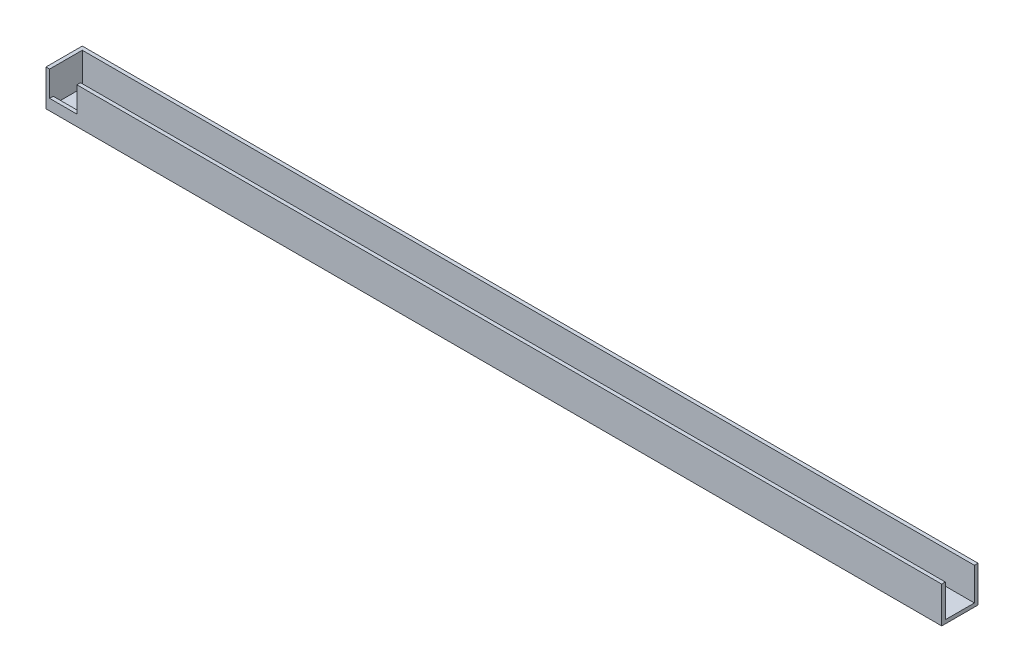
ISO-10303-21;
HEADER;
FILE_DESCRIPTION(('STEP AP214'),'2;1');
FILE_NAME('part.step','',(''),(''),'','','');
FILE_SCHEMA(('AUTOMOTIVE_DESIGN { 1 0 10303 214 1 1 1 1 }'));
ENDSEC;
DATA;
#1=APPLICATION_CONTEXT('core data for automotive mechanical design processes');
#2=APPLICATION_PROTOCOL_DEFINITION('international standard','automotive_design',2000,#1);
#3=PRODUCT_CONTEXT('',#1,'mechanical');
#4=PRODUCT('Part','Part','',(#3));
#5=PRODUCT_RELATED_PRODUCT_CATEGORY('part','',(#4));
#6=PRODUCT_DEFINITION_FORMATION('','',#4);
#7=PRODUCT_DEFINITION_CONTEXT('part definition',#1,'design');
#8=PRODUCT_DEFINITION('design','',#6,#7);
#9=PRODUCT_DEFINITION_SHAPE('','',#8);
#10=(LENGTH_UNIT() NAMED_UNIT(*) SI_UNIT(.MILLI.,.METRE.));
#11=(NAMED_UNIT(*) PLANE_ANGLE_UNIT() SI_UNIT($,.RADIAN.));
#12=(NAMED_UNIT(*) SI_UNIT($,.STERADIAN.) SOLID_ANGLE_UNIT());
#13=UNCERTAINTY_MEASURE_WITH_UNIT(LENGTH_MEASURE(1.E-05),#10,'distance_accuracy_value','');
#14=(GEOMETRIC_REPRESENTATION_CONTEXT(3) GLOBAL_UNCERTAINTY_ASSIGNED_CONTEXT((#13)) GLOBAL_UNIT_ASSIGNED_CONTEXT((#10,
#11,#12)) REPRESENTATION_CONTEXT('',''));
#15=CARTESIAN_POINT('',(0.,0.,0.));
#16=DIRECTION('',(0.,0.,1.));
#17=DIRECTION('',(1.,0.,0.));
#18=AXIS2_PLACEMENT_3D('',#15,#16,#17);
#19=CARTESIAN_POINT('',(-784.225,63.5,63.5));
#20=DIRECTION('',(0.,-1.,0.));
#21=DIRECTION('',(0.,0.,-1.));
#22=AXIS2_PLACEMENT_3D('',#19,#20,#21);
#23=PLANE('',#22);
#24=DIRECTION('',(-1.,0.,0.));
#25=VECTOR('',#24,1.);
#26=CARTESIAN_POINT('',(-784.225,63.5,63.5));
#27=LINE('',#26,#25);
#28=CARTESIAN_POINT('',(-777.875,63.5,63.5));
#29=VERTEX_POINT('',#28);
#30=CARTESIAN_POINT('',(-784.225,63.5,63.5));
#31=VERTEX_POINT('',#30);
#32=EDGE_CURVE('E212',#29,#31,#27,.T.);
#33=ORIENTED_EDGE('',*,*,#32,.F.);
#34=DIRECTION('',(0.,0.,-1.));
#35=VECTOR('',#34,1.);
#36=CARTESIAN_POINT('',(-777.875,63.5,63.5));
#37=LINE('',#36,#35);
#38=CARTESIAN_POINT('',(-777.875,63.5,6.35));
#39=VERTEX_POINT('',#38);
#40=EDGE_CURVE('E153',#29,#39,#37,.T.);
#41=ORIENTED_EDGE('',*,*,#40,.T.);
#42=DIRECTION('',(-1.,0.,0.));
#43=VECTOR('',#42,1.);
#44=CARTESIAN_POINT('',(-784.225,63.5,6.35));
#45=LINE('',#44,#43);
#46=CARTESIAN_POINT('',(784.225,63.5,6.35));
#47=VERTEX_POINT('',#46);
#48=EDGE_CURVE('E177',#47,#39,#45,.T.);
#49=ORIENTED_EDGE('',*,*,#48,.F.);
#50=DIRECTION('',(0.,0.,-1.));
#51=VECTOR('',#50,1.);
#52=CARTESIAN_POINT('',(784.225,63.5,63.5));
#53=LINE('',#52,#51);
#54=CARTESIAN_POINT('',(784.225,63.5,0.));
#55=VERTEX_POINT('',#54);
#56=EDGE_CURVE('E52',#47,#55,#53,.T.);
#57=ORIENTED_EDGE('',*,*,#56,.T.);
#58=DIRECTION('',(-1.,0.,0.));
#59=VECTOR('',#58,1.);
#60=CARTESIAN_POINT('',(-784.225,63.5,0.));
#61=LINE('',#60,#59);
#62=CARTESIAN_POINT('',(-784.225,63.5,0.));
#63=VERTEX_POINT('',#62);
#64=EDGE_CURVE('E224',#55,#63,#61,.T.);
#65=ORIENTED_EDGE('',*,*,#64,.T.);
#66=DIRECTION('',(0.,0.,-1.));
#67=VECTOR('',#66,1.);
#68=CARTESIAN_POINT('',(-784.225,63.5,63.5));
#69=LINE('',#68,#67);
#70=EDGE_CURVE('E236',#31,#63,#69,.T.);
#71=ORIENTED_EDGE('',*,*,#70,.F.);
#72=EDGE_LOOP('',(#33,#41,#49,#57,#65,#71));
#73=FACE_BOUND('',#72,.T.);
#74=ADVANCED_FACE('F43',(#73),#23,.F.);
#75=CARTESIAN_POINT('',(784.225,63.5,63.5));
#76=DIRECTION('',(-1.,0.,0.));
#77=DIRECTION('',(0.,0.,1.));
#78=AXIS2_PLACEMENT_3D('',#75,#76,#77);
#79=PLANE('',#78);
#80=DIRECTION('',(0.,1.,0.));
#81=VECTOR('',#80,1.);
#82=CARTESIAN_POINT('',(784.225,63.5,6.35));
#83=LINE('',#82,#81);
#84=CARTESIAN_POINT('',(784.225,6.35,6.35));
#85=VERTEX_POINT('',#84);
#86=EDGE_CURVE('E172',#85,#47,#83,.T.);
#87=ORIENTED_EDGE('',*,*,#86,.F.);
#88=DIRECTION('',(0.,0.,-1.));
#89=VECTOR('',#88,1.);
#90=CARTESIAN_POINT('',(784.225,6.35,63.5));
#91=LINE('',#90,#89);
#92=CARTESIAN_POINT('',(784.225,6.35,57.15));
#93=VERTEX_POINT('',#92);
#94=EDGE_CURVE('E182',#93,#85,#91,.T.);
#95=ORIENTED_EDGE('',*,*,#94,.F.);
#96=DIRECTION('',(0.,1.,0.));
#97=VECTOR('',#96,1.);
#98=CARTESIAN_POINT('',(784.225,63.5,57.15));
#99=LINE('',#98,#97);
#100=CARTESIAN_POINT('',(784.225,63.5,57.15));
#101=VERTEX_POINT('',#100);
#102=EDGE_CURVE('E190',#93,#101,#99,.T.);
#103=ORIENTED_EDGE('',*,*,#102,.T.);
#104=CARTESIAN_POINT('',(784.225,63.5,63.5));
#105=VERTEX_POINT('',#104);
#106=EDGE_CURVE('E11',#105,#101,#53,.T.);
#107=ORIENTED_EDGE('',*,*,#106,.F.);
#108=DIRECTION('',(0.,1.,0.));
#109=VECTOR('',#108,1.);
#110=CARTESIAN_POINT('',(784.225,63.5,63.5));
#111=LINE('',#110,#109);
#112=CARTESIAN_POINT('',(784.225,0.,63.5));
#113=VERTEX_POINT('',#112);
#114=EDGE_CURVE('E209',#113,#105,#111,.T.);
#115=ORIENTED_EDGE('',*,*,#114,.F.);
#116=DIRECTION('',(0.,0.,-1.));
#117=VECTOR('',#116,1.);
#118=CARTESIAN_POINT('',(784.225,0.,63.5));
#119=LINE('',#118,#117);
#120=CARTESIAN_POINT('',(784.225,0.,0.));
#121=VERTEX_POINT('',#120);
#122=EDGE_CURVE('E220',#113,#121,#119,.T.);
#123=ORIENTED_EDGE('',*,*,#122,.T.);
#124=DIRECTION('',(0.,1.,0.));
#125=VECTOR('',#124,1.);
#126=CARTESIAN_POINT('',(784.225,63.5,0.));
#127=LINE('',#126,#125);
#128=EDGE_CURVE('E195',#121,#55,#127,.T.);
#129=ORIENTED_EDGE('',*,*,#128,.T.);
#130=ORIENTED_EDGE('',*,*,#56,.F.);
#131=EDGE_LOOP('',(#87,#95,#103,#107,#115,#123,#129,#130));
#132=FACE_BOUND('',#131,.T.);
#133=ADVANCED_FACE('F45',(#132),#79,.F.);
#134=DIRECTION('',(-1.,0.,0.));
#135=VECTOR('',#134,1.);
#136=CARTESIAN_POINT('',(-784.225,63.5,57.15));
#137=LINE('',#136,#135);
#138=CARTESIAN_POINT('',(-730.123,63.5,57.15));
#139=VERTEX_POINT('',#138);
#140=EDGE_CURVE('E187',#101,#139,#137,.T.);
#141=ORIENTED_EDGE('',*,*,#140,.T.);
#142=DIRECTION('',(0.,0.,1.));
#143=VECTOR('',#142,1.);
#144=CARTESIAN_POINT('',(-730.123,63.5,-8.08845494798297));
#145=LINE('',#144,#143);
#146=CARTESIAN_POINT('',(-730.123,63.5,63.5));
#147=VERTEX_POINT('',#146);
#148=EDGE_CURVE('E164',#139,#147,#145,.T.);
#149=ORIENTED_EDGE('',*,*,#148,.T.);
#150=EDGE_CURVE('E96',#105,#147,#27,.T.);
#151=ORIENTED_EDGE('',*,*,#150,.F.);
#152=ORIENTED_EDGE('',*,*,#106,.T.);
#153=EDGE_LOOP('',(#141,#149,#151,#152));
#154=FACE_BOUND('',#153,.T.);
#155=ADVANCED_FACE('F274',(#154),#23,.F.);
#156=CARTESIAN_POINT('',(-784.225,0.,63.5));
#157=DIRECTION('',(1.,0.,0.));
#158=DIRECTION('',(0.,0.,-1.));
#159=AXIS2_PLACEMENT_3D('',#156,#157,#158);
#160=PLANE('',#159);
#161=DIRECTION('',(0.,-1.,0.));
#162=VECTOR('',#161,1.);
#163=CARTESIAN_POINT('',(-784.225,0.,0.));
#164=LINE('',#163,#162);
#165=CARTESIAN_POINT('',(-784.225,0.,0.));
#166=VERTEX_POINT('',#165);
#167=EDGE_CURVE('E227',#63,#166,#164,.T.);
#168=ORIENTED_EDGE('',*,*,#167,.T.);
#169=DIRECTION('',(0.,0.,-1.));
#170=VECTOR('',#169,1.);
#171=CARTESIAN_POINT('',(-784.225,0.,63.5));
#172=LINE('',#171,#170);
#173=CARTESIAN_POINT('',(-784.225,0.,63.5));
#174=VERTEX_POINT('',#173);
#175=EDGE_CURVE('E234',#174,#166,#172,.T.);
#176=ORIENTED_EDGE('',*,*,#175,.F.);
#177=DIRECTION('',(0.,-1.,0.));
#178=VECTOR('',#177,1.);
#179=CARTESIAN_POINT('',(-784.225,0.,63.5));
#180=LINE('',#179,#178);
#181=EDGE_CURVE('E215',#31,#174,#180,.T.);
#182=ORIENTED_EDGE('',*,*,#181,.F.);
#183=ORIENTED_EDGE('',*,*,#70,.T.);
#184=EDGE_LOOP('',(#168,#176,#182,#183));
#185=FACE_BOUND('',#184,.T.);
#186=ADVANCED_FACE('F257',(#185),#160,.F.);
#187=CARTESIAN_POINT('',(-784.225,0.,63.5));
#188=DIRECTION('',(0.,1.,0.));
#189=DIRECTION('',(0.,0.,1.));
#190=AXIS2_PLACEMENT_3D('',#187,#188,#189);
#191=PLANE('',#190);
#192=DIRECTION('',(1.,0.,0.));
#193=VECTOR('',#192,1.);
#194=CARTESIAN_POINT('',(-784.225,0.,0.));
#195=LINE('',#194,#193);
#196=EDGE_CURVE('E89',#166,#121,#195,.T.);
#197=ORIENTED_EDGE('',*,*,#196,.T.);
#198=ORIENTED_EDGE('',*,*,#122,.F.);
#199=DIRECTION('',(1.,0.,0.));
#200=VECTOR('',#199,1.);
#201=CARTESIAN_POINT('',(-784.225,0.,63.5));
#202=LINE('',#201,#200);
#203=EDGE_CURVE('E68',#174,#113,#202,.T.);
#204=ORIENTED_EDGE('',*,*,#203,.F.);
#205=ORIENTED_EDGE('',*,*,#175,.T.);
#206=EDGE_LOOP('',(#197,#198,#204,#205));
#207=FACE_BOUND('',#206,.T.);
#208=ADVANCED_FACE('F255',(#207),#191,.F.);
#209=CARTESIAN_POINT('',(0.,0.,63.5));
#210=DIRECTION('',(0.,0.,1.));
#211=DIRECTION('',(1.,0.,0.));
#212=AXIS2_PLACEMENT_3D('',#209,#210,#211);
#213=PLANE('',#212);
#214=DIRECTION('',(0.,-1.,0.));
#215=VECTOR('',#214,1.);
#216=CARTESIAN_POINT('',(-777.875,63.5,63.5));
#217=LINE('',#216,#215);
#218=CARTESIAN_POINT('',(-777.875,19.05,63.5));
#219=VERTEX_POINT('',#218);
#220=EDGE_CURVE('E149',#29,#219,#217,.T.);
#221=ORIENTED_EDGE('',*,*,#220,.F.);
#222=ORIENTED_EDGE('',*,*,#32,.T.);
#223=ORIENTED_EDGE('',*,*,#181,.T.);
#224=ORIENTED_EDGE('',*,*,#203,.T.);
#225=ORIENTED_EDGE('',*,*,#114,.T.);
#226=ORIENTED_EDGE('',*,*,#150,.T.);
#227=DIRECTION('',(0.,1.,0.));
#228=VECTOR('',#227,1.);
#229=CARTESIAN_POINT('',(-730.123,63.5,63.5));
#230=LINE('',#229,#228);
#231=CARTESIAN_POINT('',(-730.123,19.05,63.5));
#232=VERTEX_POINT('',#231);
#233=EDGE_CURVE('E146',#232,#147,#230,.T.);
#234=ORIENTED_EDGE('',*,*,#233,.F.);
#235=DIRECTION('',(1.,0.,0.));
#236=VECTOR('',#235,1.);
#237=CARTESIAN_POINT('',(-777.875,19.05,63.5));
#238=LINE('',#237,#236);
#239=EDGE_CURVE('E139',#219,#232,#238,.T.);
#240=ORIENTED_EDGE('',*,*,#239,.F.);
#241=EDGE_LOOP('',(#221,#222,#223,#224,#225,#226,#234,#240));
#242=FACE_BOUND('',#241,.T.);
#243=ADVANCED_FACE('F157',(#242),#213,.T.);
#244=CARTESIAN_POINT('',(0.,0.,0.));
#245=DIRECTION('',(0.,0.,1.));
#246=DIRECTION('',(1.,0.,0.));
#247=AXIS2_PLACEMENT_3D('',#244,#245,#246);
#248=PLANE('',#247);
#249=ORIENTED_EDGE('',*,*,#128,.F.);
#250=ORIENTED_EDGE('',*,*,#196,.F.);
#251=ORIENTED_EDGE('',*,*,#167,.F.);
#252=ORIENTED_EDGE('',*,*,#64,.F.);
#253=EDGE_LOOP('',(#249,#250,#251,#252));
#254=FACE_BOUND('',#253,.T.);
#255=ADVANCED_FACE('F252',(#254),#248,.F.);
#256=CARTESIAN_POINT('',(-777.875,0.,63.5));
#257=DIRECTION('',(1.,0.,0.));
#258=DIRECTION('',(0.,0.,-1.));
#259=AXIS2_PLACEMENT_3D('',#256,#257,#258);
#260=PLANE('',#259);
#261=DIRECTION('',(0.,-1.,0.));
#262=VECTOR('',#261,1.);
#263=CARTESIAN_POINT('',(-777.875,0.,6.35));
#264=LINE('',#263,#262);
#265=CARTESIAN_POINT('',(-777.875,6.35,6.35));
#266=VERTEX_POINT('',#265);
#267=EDGE_CURVE('E173',#39,#266,#264,.T.);
#268=ORIENTED_EDGE('',*,*,#267,.F.);
#269=ORIENTED_EDGE('',*,*,#40,.F.);
#270=ORIENTED_EDGE('',*,*,#220,.T.);
#271=DIRECTION('',(0.,0.,1.));
#272=VECTOR('',#271,1.);
#273=CARTESIAN_POINT('',(-777.875,19.05,-8.08845494798297));
#274=LINE('',#273,#272);
#275=CARTESIAN_POINT('',(-777.875,19.05,57.15));
#276=VERTEX_POINT('',#275);
#277=EDGE_CURVE('E135',#276,#219,#274,.T.);
#278=ORIENTED_EDGE('',*,*,#277,.F.);
#279=DIRECTION('',(0.,-1.,0.));
#280=VECTOR('',#279,1.);
#281=CARTESIAN_POINT('',(-777.875,0.,57.15));
#282=LINE('',#281,#280);
#283=CARTESIAN_POINT('',(-777.875,6.35,57.15));
#284=VERTEX_POINT('',#283);
#285=EDGE_CURVE('E183',#276,#284,#282,.T.);
#286=ORIENTED_EDGE('',*,*,#285,.T.);
#287=DIRECTION('',(0.,0.,-1.));
#288=VECTOR('',#287,1.);
#289=CARTESIAN_POINT('',(-777.875,6.35,63.5));
#290=LINE('',#289,#288);
#291=EDGE_CURVE('E178',#284,#266,#290,.T.);
#292=ORIENTED_EDGE('',*,*,#291,.T.);
#293=EDGE_LOOP('',(#268,#269,#270,#278,#286,#292));
#294=FACE_BOUND('',#293,.T.);
#295=ADVANCED_FACE('F151',(#294),#260,.T.);
#296=CARTESIAN_POINT('',(-784.225,6.35,63.5));
#297=DIRECTION('',(0.,1.,0.));
#298=DIRECTION('',(0.,0.,1.));
#299=AXIS2_PLACEMENT_3D('',#296,#297,#298);
#300=PLANE('',#299);
#301=DIRECTION('',(1.,0.,0.));
#302=VECTOR('',#301,1.);
#303=CARTESIAN_POINT('',(-784.225,6.35,6.35));
#304=LINE('',#303,#302);
#305=EDGE_CURVE('E176',#266,#85,#304,.T.);
#306=ORIENTED_EDGE('',*,*,#305,.F.);
#307=ORIENTED_EDGE('',*,*,#291,.F.);
#308=DIRECTION('',(1.,0.,0.));
#309=VECTOR('',#308,1.);
#310=CARTESIAN_POINT('',(-784.225,6.35,57.15));
#311=LINE('',#310,#309);
#312=EDGE_CURVE('E186',#284,#93,#311,.T.);
#313=ORIENTED_EDGE('',*,*,#312,.T.);
#314=ORIENTED_EDGE('',*,*,#94,.T.);
#315=EDGE_LOOP('',(#306,#307,#313,#314));
#316=FACE_BOUND('',#315,.T.);
#317=ADVANCED_FACE('F270',(#316),#300,.T.);
#318=CARTESIAN_POINT('',(0.,0.,57.15));
#319=DIRECTION('',(0.,0.,1.));
#320=DIRECTION('',(1.,0.,0.));
#321=AXIS2_PLACEMENT_3D('',#318,#319,#320);
#322=PLANE('',#321);
#323=DIRECTION('',(-1.,0.,0.));
#324=VECTOR('',#323,1.);
#325=CARTESIAN_POINT('',(-777.875,19.05,57.15));
#326=LINE('',#325,#324);
#327=CARTESIAN_POINT('',(-730.123,19.05,57.15));
#328=VERTEX_POINT('',#327);
#329=EDGE_CURVE('E142',#328,#276,#326,.T.);
#330=ORIENTED_EDGE('',*,*,#329,.F.);
#331=DIRECTION('',(0.,-1.,0.));
#332=VECTOR('',#331,1.);
#333=CARTESIAN_POINT('',(-730.123,63.5,57.15));
#334=LINE('',#333,#332);
#335=EDGE_CURVE('E167',#139,#328,#334,.T.);
#336=ORIENTED_EDGE('',*,*,#335,.F.);
#337=ORIENTED_EDGE('',*,*,#140,.F.);
#338=ORIENTED_EDGE('',*,*,#102,.F.);
#339=ORIENTED_EDGE('',*,*,#312,.F.);
#340=ORIENTED_EDGE('',*,*,#285,.F.);
#341=EDGE_LOOP('',(#330,#336,#337,#338,#339,#340));
#342=FACE_BOUND('',#341,.T.);
#343=ADVANCED_FACE('F264',(#342),#322,.F.);
#344=CARTESIAN_POINT('',(0.,0.,6.35));
#345=DIRECTION('',(0.,0.,1.));
#346=DIRECTION('',(1.,0.,0.));
#347=AXIS2_PLACEMENT_3D('',#344,#345,#346);
#348=PLANE('',#347);
#349=ORIENTED_EDGE('',*,*,#86,.T.);
#350=ORIENTED_EDGE('',*,*,#48,.T.);
#351=ORIENTED_EDGE('',*,*,#267,.T.);
#352=ORIENTED_EDGE('',*,*,#305,.T.);
#353=EDGE_LOOP('',(#349,#350,#351,#352));
#354=FACE_BOUND('',#353,.T.);
#355=ADVANCED_FACE('F273',(#354),#348,.T.);
#356=CARTESIAN_POINT('',(-730.123,63.5,-8.08845494798297));
#357=DIRECTION('',(1.,0.,0.));
#358=DIRECTION('',(0.,0.,-1.));
#359=AXIS2_PLACEMENT_3D('',#356,#357,#358);
#360=PLANE('',#359);
#361=ORIENTED_EDGE('',*,*,#335,.T.);
#362=DIRECTION('',(0.,0.,1.));
#363=VECTOR('',#362,1.);
#364=CARTESIAN_POINT('',(-730.123,19.05,-8.08845494798297));
#365=LINE('',#364,#363);
#366=EDGE_CURVE('E59',#328,#232,#365,.T.);
#367=ORIENTED_EDGE('',*,*,#366,.T.);
#368=ORIENTED_EDGE('',*,*,#233,.T.);
#369=ORIENTED_EDGE('',*,*,#148,.F.);
#370=EDGE_LOOP('',(#361,#367,#368,#369));
#371=FACE_BOUND('',#370,.T.);
#372=ADVANCED_FACE('F262',(#371),#360,.F.);
#373=CARTESIAN_POINT('',(-777.875,19.05,-8.08845494798297));
#374=DIRECTION('',(0.,-1.,0.));
#375=DIRECTION('',(0.,0.,-1.));
#376=AXIS2_PLACEMENT_3D('',#373,#374,#375);
#377=PLANE('',#376);
#378=ORIENTED_EDGE('',*,*,#329,.T.);
#379=ORIENTED_EDGE('',*,*,#277,.T.);
#380=ORIENTED_EDGE('',*,*,#239,.T.);
#381=ORIENTED_EDGE('',*,*,#366,.F.);
#382=EDGE_LOOP('',(#378,#379,#380,#381));
#383=FACE_BOUND('',#382,.T.);
#384=ADVANCED_FACE('F137',(#383),#377,.F.);
#385=CLOSED_SHELL('',(#74,#133,#155,#186,#208,#243,#255,#295,#317,#343,#355,#372,#384));
#386=MANIFOLD_SOLID_BREP('B2',#385);
#387=ADVANCED_BREP_SHAPE_REPRESENTATION('',(#18,#386),#14);
#388=SHAPE_DEFINITION_REPRESENTATION(#9,#387);
ENDSEC;
END-ISO-10303-21;
